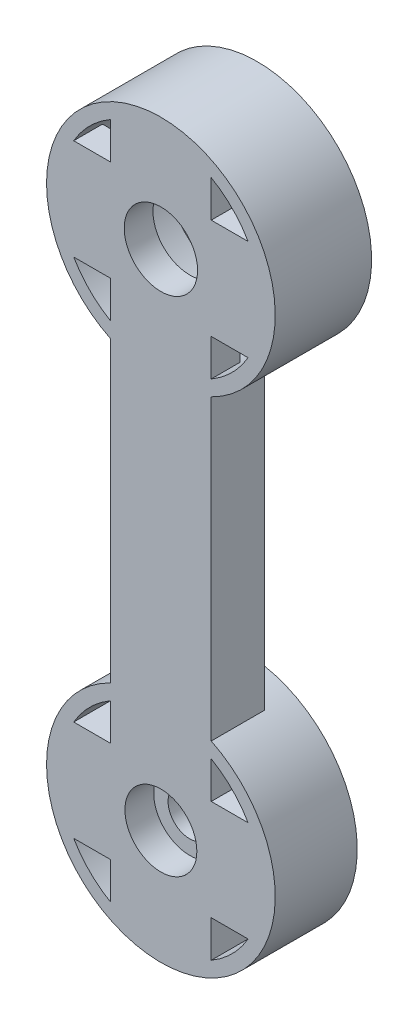
ISO-10303-21;
HEADER;
FILE_DESCRIPTION(('STEP AP214'),'2;1');
FILE_NAME('part.step','',(''),(''),'','','');
FILE_SCHEMA(('AUTOMOTIVE_DESIGN { 1 0 10303 214 1 1 1 1 }'));
ENDSEC;
DATA;
#1=APPLICATION_CONTEXT('core data for automotive mechanical design processes');
#2=APPLICATION_PROTOCOL_DEFINITION('international standard','automotive_design',2000,#1);
#3=PRODUCT_CONTEXT('',#1,'mechanical');
#4=PRODUCT('Part','Part','',(#3));
#5=PRODUCT_RELATED_PRODUCT_CATEGORY('part','',(#4));
#6=PRODUCT_DEFINITION_FORMATION('','',#4);
#7=PRODUCT_DEFINITION_CONTEXT('part definition',#1,'design');
#8=PRODUCT_DEFINITION('design','',#6,#7);
#9=PRODUCT_DEFINITION_SHAPE('','',#8);
#10=(LENGTH_UNIT() NAMED_UNIT(*) SI_UNIT(.MILLI.,.METRE.));
#11=(NAMED_UNIT(*) PLANE_ANGLE_UNIT() SI_UNIT($,.RADIAN.));
#12=(NAMED_UNIT(*) SI_UNIT($,.STERADIAN.) SOLID_ANGLE_UNIT());
#13=UNCERTAINTY_MEASURE_WITH_UNIT(LENGTH_MEASURE(1.E-05),#10,'distance_accuracy_value','');
#14=(GEOMETRIC_REPRESENTATION_CONTEXT(3) GLOBAL_UNCERTAINTY_ASSIGNED_CONTEXT((#13)) GLOBAL_UNIT_ASSIGNED_CONTEXT((#10,
#11,#12)) REPRESENTATION_CONTEXT('',''));
#15=CARTESIAN_POINT('',(0.,0.,0.));
#16=DIRECTION('',(0.,0.,1.));
#17=DIRECTION('',(1.,0.,0.));
#18=AXIS2_PLACEMENT_3D('',#15,#16,#17);
#19=CARTESIAN_POINT('',(0.,-35.,3.));
#20=DIRECTION('',(0.,0.,-1.));
#21=DIRECTION('',(-1.,0.,0.));
#22=AXIS2_PLACEMENT_3D('',#19,#20,#21);
#23=CYLINDRICAL_SURFACE('',#22,7.95);
#24=CARTESIAN_POINT('',(0.,-35.,-2.7));
#25=DIRECTION('',(0.,0.,-1.));
#26=DIRECTION('',(-1.,0.,0.));
#27=AXIS2_PLACEMENT_3D('',#24,#25,#26);
#28=CIRCLE('',#27,7.95);
#29=CARTESIAN_POINT('',(-7.95,-35.,-2.7));
#30=VERTEX_POINT('',#29);
#31=EDGE_CURVE('E315',#30,#30,#28,.T.);
#32=ORIENTED_EDGE('',*,*,#31,.F.);
#33=EDGE_LOOP('',(#32));
#34=FACE_BOUND('',#33,.T.);
#35=CARTESIAN_POINT('',(0.,-35.,-0.7));
#36=DIRECTION('',(0.,0.,-1.));
#37=DIRECTION('',(-1.,0.,0.));
#38=AXIS2_PLACEMENT_3D('',#35,#36,#37);
#39=CIRCLE('',#38,7.95);
#40=CARTESIAN_POINT('',(3.50000000000001,-27.8618980113759,-0.7));
#41=VERTEX_POINT('',#40);
#42=CARTESIAN_POINT('',(-3.5,-27.8618980113759,-0.7));
#43=VERTEX_POINT('',#42);
#44=EDGE_CURVE('E257',#41,#43,#39,.F.);
#45=ORIENTED_EDGE('',*,*,#44,.F.);
#46=DIRECTION('',(0.,0.,-1.));
#47=VECTOR('',#46,1.);
#48=CARTESIAN_POINT('',(3.5,-27.8618980113759,3.));
#49=LINE('',#48,#47);
#50=CARTESIAN_POINT('',(3.5,-27.8618980113759,3.));
#51=VERTEX_POINT('',#50);
#52=EDGE_CURVE('E248',#51,#41,#49,.T.);
#53=ORIENTED_EDGE('',*,*,#52,.F.);
#54=CARTESIAN_POINT('',(0.,-35.,3.));
#55=DIRECTION('',(0.,0.,1.));
#56=DIRECTION('',(1.,0.,0.));
#57=AXIS2_PLACEMENT_3D('',#54,#55,#56);
#58=CIRCLE('',#57,7.95);
#59=CARTESIAN_POINT('',(-3.5,-27.8618980113759,3.));
#60=VERTEX_POINT('',#59);
#61=EDGE_CURVE('E388',#51,#60,#58,.F.);
#62=ORIENTED_EDGE('',*,*,#61,.T.);
#63=DIRECTION('',(0.,0.,-1.));
#64=VECTOR('',#63,1.);
#65=CARTESIAN_POINT('',(-3.5,-27.8618980113759,3.));
#66=LINE('',#65,#64);
#67=EDGE_CURVE('E519',#60,#43,#66,.T.);
#68=ORIENTED_EDGE('',*,*,#67,.T.);
#69=EDGE_LOOP('',(#45,#53,#62,#68));
#70=FACE_BOUND('',#69,.T.);
#71=ADVANCED_FACE('F47',(#34,#70),#23,.T.);
#72=CARTESIAN_POINT('',(0.,0.,3.));
#73=DIRECTION('',(0.,0.,-1.));
#74=DIRECTION('',(-1.,0.,0.));
#75=AXIS2_PLACEMENT_3D('',#72,#73,#74);
#76=CYLINDRICAL_SURFACE('',#75,7.95);
#77=CARTESIAN_POINT('',(0.,0.,-3.7));
#78=DIRECTION('',(0.,0.,-1.));
#79=DIRECTION('',(-1.,0.,0.));
#80=AXIS2_PLACEMENT_3D('',#77,#78,#79);
#81=CIRCLE('',#80,7.95);
#82=CARTESIAN_POINT('',(-7.95,0.,-3.7));
#83=VERTEX_POINT('',#82);
#84=EDGE_CURVE('E323',#83,#83,#81,.T.);
#85=ORIENTED_EDGE('',*,*,#84,.F.);
#86=EDGE_LOOP('',(#85));
#87=FACE_BOUND('',#86,.T.);
#88=DIRECTION('',(0.,0.,-1.));
#89=VECTOR('',#88,1.);
#90=CARTESIAN_POINT('',(3.5,-7.13810198862415,3.));
#91=LINE('',#90,#89);
#92=CARTESIAN_POINT('',(3.5,-7.13810198862415,3.));
#93=VERTEX_POINT('',#92);
#94=CARTESIAN_POINT('',(3.5,-7.13810198862415,-0.7));
#95=VERTEX_POINT('',#94);
#96=EDGE_CURVE('E238',#93,#95,#91,.T.);
#97=ORIENTED_EDGE('',*,*,#96,.T.);
#98=CARTESIAN_POINT('',(0.,0.,-0.7));
#99=DIRECTION('',(0.,0.,-1.));
#100=DIRECTION('',(-1.,0.,0.));
#101=AXIS2_PLACEMENT_3D('',#98,#99,#100);
#102=CIRCLE('',#101,7.95);
#103=CARTESIAN_POINT('',(-3.5,-7.13810198862415,-0.7));
#104=VERTEX_POINT('',#103);
#105=EDGE_CURVE('E242',#104,#95,#102,.F.);
#106=ORIENTED_EDGE('',*,*,#105,.F.);
#107=DIRECTION('',(0.,0.,-1.));
#108=VECTOR('',#107,1.);
#109=CARTESIAN_POINT('',(-3.5,-7.13810198862415,3.));
#110=LINE('',#109,#108);
#111=CARTESIAN_POINT('',(-3.5,-7.13810198862415,3.));
#112=VERTEX_POINT('',#111);
#113=EDGE_CURVE('E65',#112,#104,#110,.T.);
#114=ORIENTED_EDGE('',*,*,#113,.F.);
#115=CARTESIAN_POINT('',(0.,0.,3.));
#116=DIRECTION('',(0.,0.,1.));
#117=DIRECTION('',(1.,0.,0.));
#118=AXIS2_PLACEMENT_3D('',#115,#116,#117);
#119=CIRCLE('',#118,7.95);
#120=EDGE_CURVE('E243',#93,#112,#119,.T.);
#121=ORIENTED_EDGE('',*,*,#120,.F.);
#122=EDGE_LOOP('',(#97,#106,#114,#121));
#123=FACE_BOUND('',#122,.T.);
#124=ADVANCED_FACE('F240',(#87,#123),#76,.T.);
#125=CARTESIAN_POINT('',(0.,-35.,3.));
#126=DIRECTION('',(0.,0.,-1.));
#127=DIRECTION('',(-1.,0.,0.));
#128=AXIS2_PLACEMENT_3D('',#125,#126,#127);
#129=CYLINDRICAL_SURFACE('',#128,1.5);
#130=CARTESIAN_POINT('',(0.,-35.,1.));
#131=DIRECTION('',(0.,0.,1.));
#132=DIRECTION('',(1.,0.,0.));
#133=AXIS2_PLACEMENT_3D('',#130,#131,#132);
#134=CIRCLE('',#133,1.5);
#135=CARTESIAN_POINT('',(1.5,-35.,1.));
#136=VERTEX_POINT('',#135);
#137=EDGE_CURVE('E331',#136,#136,#134,.F.);
#138=ORIENTED_EDGE('',*,*,#137,.F.);
#139=EDGE_LOOP('',(#138));
#140=FACE_BOUND('',#139,.T.);
#141=CARTESIAN_POINT('',(0.,-35.,-2.7));
#142=DIRECTION('',(0.,0.,-1.));
#143=DIRECTION('',(-1.,0.,0.));
#144=AXIS2_PLACEMENT_3D('',#141,#142,#143);
#145=CIRCLE('',#144,1.5);
#146=CARTESIAN_POINT('',(-1.5,-35.,-2.7));
#147=VERTEX_POINT('',#146);
#148=EDGE_CURVE('E303',#147,#147,#145,.F.);
#149=ORIENTED_EDGE('',*,*,#148,.F.);
#150=EDGE_LOOP('',(#149));
#151=FACE_BOUND('',#150,.T.);
#152=ADVANCED_FACE('F552',(#140,#151),#129,.F.);
#153=CARTESIAN_POINT('',(0.,-31.5,3.));
#154=DIRECTION('',(0.,-1.,0.));
#155=DIRECTION('',(0.,0.,-1.));
#156=AXIS2_PLACEMENT_3D('',#153,#154,#155);
#157=PLANE('',#156);
#158=DIRECTION('',(0.,0.,-1.));
#159=VECTOR('',#158,1.);
#160=CARTESIAN_POINT('',(6.06217782649107,-31.5,3.));
#161=LINE('',#160,#159);
#162=CARTESIAN_POINT('',(6.06217782649107,-31.5,3.));
#163=VERTEX_POINT('',#162);
#164=CARTESIAN_POINT('',(6.06217782649107,-31.5,-2.7));
#165=VERTEX_POINT('',#164);
#166=EDGE_CURVE('E494',#163,#165,#161,.T.);
#167=ORIENTED_EDGE('',*,*,#166,.T.);
#168=DIRECTION('',(1.,0.,0.));
#169=VECTOR('',#168,1.);
#170=CARTESIAN_POINT('',(0.,-31.5,-2.7));
#171=LINE('',#170,#169);
#172=CARTESIAN_POINT('',(3.5,-31.5,-2.7));
#173=VERTEX_POINT('',#172);
#174=EDGE_CURVE('E282',#173,#165,#171,.T.);
#175=ORIENTED_EDGE('',*,*,#174,.F.);
#176=DIRECTION('',(0.,0.,-1.));
#177=VECTOR('',#176,1.);
#178=CARTESIAN_POINT('',(3.5,-31.5,3.));
#179=LINE('',#178,#177);
#180=CARTESIAN_POINT('',(3.5,-31.5,3.));
#181=VERTEX_POINT('',#180);
#182=EDGE_CURVE('E487',#181,#173,#179,.T.);
#183=ORIENTED_EDGE('',*,*,#182,.F.);
#184=DIRECTION('',(-1.,0.,0.));
#185=VECTOR('',#184,1.);
#186=CARTESIAN_POINT('',(0.,-31.5,3.));
#187=LINE('',#186,#185);
#188=EDGE_CURVE('E418',#163,#181,#187,.T.);
#189=ORIENTED_EDGE('',*,*,#188,.F.);
#190=EDGE_LOOP('',(#167,#175,#183,#189));
#191=FACE_BOUND('',#190,.T.);
#192=ADVANCED_FACE('F555',(#191),#157,.F.);
#193=CARTESIAN_POINT('',(3.5,0.,3.));
#194=DIRECTION('',(1.,0.,0.));
#195=DIRECTION('',(0.,1.,0.));
#196=AXIS2_PLACEMENT_3D('',#193,#194,#195);
#197=PLANE('',#196);
#198=ORIENTED_EDGE('',*,*,#182,.T.);
#199=DIRECTION('',(0.,-1.,0.));
#200=VECTOR('',#199,1.);
#201=CARTESIAN_POINT('',(3.5,0.,-2.7));
#202=LINE('',#201,#200);
#203=CARTESIAN_POINT('',(3.5,-28.9378221735089,-2.7));
#204=VERTEX_POINT('',#203);
#205=EDGE_CURVE('E276',#204,#173,#202,.T.);
#206=ORIENTED_EDGE('',*,*,#205,.F.);
#207=DIRECTION('',(0.,0.,-1.));
#208=VECTOR('',#207,1.);
#209=CARTESIAN_POINT('',(3.5,-28.9378221735089,3.));
#210=LINE('',#209,#208);
#211=CARTESIAN_POINT('',(3.5,-28.9378221735089,3.));
#212=VERTEX_POINT('',#211);
#213=EDGE_CURVE('E497',#212,#204,#210,.T.);
#214=ORIENTED_EDGE('',*,*,#213,.F.);
#215=DIRECTION('',(0.,-1.,0.));
#216=VECTOR('',#215,1.);
#217=CARTESIAN_POINT('',(3.5,0.,3.));
#218=LINE('',#217,#216);
#219=EDGE_CURVE('E421',#212,#181,#218,.T.);
#220=ORIENTED_EDGE('',*,*,#219,.T.);
#221=EDGE_LOOP('',(#198,#206,#214,#220));
#222=FACE_BOUND('',#221,.T.);
#223=ADVANCED_FACE('F676',(#222),#197,.T.);
#224=CARTESIAN_POINT('',(0.,-31.5,3.));
#225=DIRECTION('',(0.,-1.,0.));
#226=DIRECTION('',(0.,0.,-1.));
#227=AXIS2_PLACEMENT_3D('',#224,#225,#226);
#228=PLANE('',#227);
#229=DIRECTION('',(0.,0.,-1.));
#230=VECTOR('',#229,1.);
#231=CARTESIAN_POINT('',(-3.5,-31.5,3.));
#232=LINE('',#231,#230);
#233=CARTESIAN_POINT('',(-3.5,-31.5,3.));
#234=VERTEX_POINT('',#233);
#235=CARTESIAN_POINT('',(-3.5,-31.5,-2.7));
#236=VERTEX_POINT('',#235);
#237=EDGE_CURVE('E515',#234,#236,#232,.T.);
#238=ORIENTED_EDGE('',*,*,#237,.T.);
#239=DIRECTION('',(1.,0.,0.));
#240=VECTOR('',#239,1.);
#241=CARTESIAN_POINT('',(0.,-31.5,-2.7));
#242=LINE('',#241,#240);
#243=CARTESIAN_POINT('',(-6.06217782649107,-31.5,-2.7));
#244=VERTEX_POINT('',#243);
#245=EDGE_CURVE('E311',#244,#236,#242,.T.);
#246=ORIENTED_EDGE('',*,*,#245,.F.);
#247=DIRECTION('',(0.,0.,-1.));
#248=VECTOR('',#247,1.);
#249=CARTESIAN_POINT('',(-6.06217782649107,-31.5,3.));
#250=LINE('',#249,#248);
#251=CARTESIAN_POINT('',(-6.06217782649107,-31.5,3.));
#252=VERTEX_POINT('',#251);
#253=EDGE_CURVE('E508',#252,#244,#250,.T.);
#254=ORIENTED_EDGE('',*,*,#253,.F.);
#255=DIRECTION('',(-1.,0.,0.));
#256=VECTOR('',#255,1.);
#257=CARTESIAN_POINT('',(0.,-31.5,3.));
#258=LINE('',#257,#256);
#259=EDGE_CURVE('E397',#234,#252,#258,.T.);
#260=ORIENTED_EDGE('',*,*,#259,.F.);
#261=EDGE_LOOP('',(#238,#246,#254,#260));
#262=FACE_BOUND('',#261,.T.);
#263=ADVANCED_FACE('F674',(#262),#228,.F.);
#264=CARTESIAN_POINT('',(0.,-35.,3.));
#265=DIRECTION('',(0.,0.,-1.));
#266=DIRECTION('',(-1.,0.,0.));
#267=AXIS2_PLACEMENT_3D('',#264,#265,#266);
#268=CYLINDRICAL_SURFACE('',#267,7.);
#269=ORIENTED_EDGE('',*,*,#253,.T.);
#270=CARTESIAN_POINT('',(0.,-35.,-2.7));
#271=DIRECTION('',(0.,0.,-1.));
#272=DIRECTION('',(-1.,0.,0.));
#273=AXIS2_PLACEMENT_3D('',#270,#271,#272);
#274=CIRCLE('',#273,7.);
#275=CARTESIAN_POINT('',(-3.5,-28.9378221735089,-2.7));
#276=VERTEX_POINT('',#275);
#277=EDGE_CURVE('E277',#244,#276,#274,.T.);
#278=ORIENTED_EDGE('',*,*,#277,.T.);
#279=DIRECTION('',(0.,0.,-1.));
#280=VECTOR('',#279,1.);
#281=CARTESIAN_POINT('',(-3.5,-28.9378221735089,3.));
#282=LINE('',#281,#280);
#283=CARTESIAN_POINT('',(-3.5,-28.9378221735089,3.));
#284=VERTEX_POINT('',#283);
#285=EDGE_CURVE('E518',#284,#276,#282,.T.);
#286=ORIENTED_EDGE('',*,*,#285,.F.);
#287=CARTESIAN_POINT('',(0.,-35.,3.));
#288=DIRECTION('',(0.,0.,1.));
#289=DIRECTION('',(1.,0.,0.));
#290=AXIS2_PLACEMENT_3D('',#287,#288,#289);
#291=CIRCLE('',#290,7.);
#292=EDGE_CURVE('E401',#252,#284,#291,.F.);
#293=ORIENTED_EDGE('',*,*,#292,.F.);
#294=EDGE_LOOP('',(#269,#278,#286,#293));
#295=FACE_BOUND('',#294,.T.);
#296=ADVANCED_FACE('F667',(#295),#268,.F.);
#297=CARTESIAN_POINT('',(3.50000000000003,0.,3.));
#298=DIRECTION('',(1.,0.,0.));
#299=DIRECTION('',(0.,1.,0.));
#300=AXIS2_PLACEMENT_3D('',#297,#298,#299);
#301=PLANE('',#300);
#302=DIRECTION('',(0.,0.,-1.));
#303=VECTOR('',#302,1.);
#304=CARTESIAN_POINT('',(3.5,-41.0621778264911,3.));
#305=LINE('',#304,#303);
#306=CARTESIAN_POINT('',(3.5,-41.0621778264911,3.));
#307=VERTEX_POINT('',#306);
#308=CARTESIAN_POINT('',(3.5,-41.0621778264911,-2.7));
#309=VERTEX_POINT('',#308);
#310=EDGE_CURVE('E531',#307,#309,#305,.T.);
#311=ORIENTED_EDGE('',*,*,#310,.T.);
#312=DIRECTION('',(0.,-1.,0.));
#313=VECTOR('',#312,1.);
#314=CARTESIAN_POINT('',(3.50000000000003,0.,-2.7));
#315=LINE('',#314,#313);
#316=CARTESIAN_POINT('',(3.5,-38.5,-2.7));
#317=VERTEX_POINT('',#316);
#318=EDGE_CURVE('E290',#317,#309,#315,.T.);
#319=ORIENTED_EDGE('',*,*,#318,.F.);
#320=DIRECTION('',(0.,0.,-1.));
#321=VECTOR('',#320,1.);
#322=CARTESIAN_POINT('',(3.5,-38.5,3.));
#323=LINE('',#322,#321);
#324=CARTESIAN_POINT('',(3.5,-38.5,3.));
#325=VERTEX_POINT('',#324);
#326=EDGE_CURVE('E525',#325,#317,#323,.T.);
#327=ORIENTED_EDGE('',*,*,#326,.F.);
#328=DIRECTION('',(0.,-1.,0.));
#329=VECTOR('',#328,1.);
#330=CARTESIAN_POINT('',(3.50000000000003,0.,3.));
#331=LINE('',#330,#329);
#332=EDGE_CURVE('E376',#325,#307,#331,.T.);
#333=ORIENTED_EDGE('',*,*,#332,.T.);
#334=EDGE_LOOP('',(#311,#319,#327,#333));
#335=FACE_BOUND('',#334,.T.);
#336=ADVANCED_FACE('F652',(#335),#301,.T.);
#337=CARTESIAN_POINT('',(0.,-38.5,3.));
#338=DIRECTION('',(0.,-1.,0.));
#339=DIRECTION('',(0.,0.,-1.));
#340=AXIS2_PLACEMENT_3D('',#337,#338,#339);
#341=PLANE('',#340);
#342=ORIENTED_EDGE('',*,*,#326,.T.);
#343=DIRECTION('',(-1.,0.,0.));
#344=VECTOR('',#343,1.);
#345=CARTESIAN_POINT('',(0.,-38.5,-2.7));
#346=LINE('',#345,#344);
#347=CARTESIAN_POINT('',(6.06217782649107,-38.5,-2.7));
#348=VERTEX_POINT('',#347);
#349=EDGE_CURVE('E286',#348,#317,#346,.T.);
#350=ORIENTED_EDGE('',*,*,#349,.F.);
#351=DIRECTION('',(0.,0.,-1.));
#352=VECTOR('',#351,1.);
#353=CARTESIAN_POINT('',(6.06217782649107,-38.5,3.));
#354=LINE('',#353,#352);
#355=CARTESIAN_POINT('',(6.06217782649107,-38.5,3.));
#356=VERTEX_POINT('',#355);
#357=EDGE_CURVE('E534',#356,#348,#354,.T.);
#358=ORIENTED_EDGE('',*,*,#357,.F.);
#359=DIRECTION('',(-1.,0.,0.));
#360=VECTOR('',#359,1.);
#361=CARTESIAN_POINT('',(0.,-38.5,3.));
#362=LINE('',#361,#360);
#363=EDGE_CURVE('E381',#356,#325,#362,.T.);
#364=ORIENTED_EDGE('',*,*,#363,.T.);
#365=EDGE_LOOP('',(#342,#350,#358,#364));
#366=FACE_BOUND('',#365,.T.);
#367=ADVANCED_FACE('F655',(#366),#341,.T.);
#368=CARTESIAN_POINT('',(0.,-38.5,3.));
#369=DIRECTION('',(0.,-1.,0.));
#370=DIRECTION('',(0.,0.,-1.));
#371=AXIS2_PLACEMENT_3D('',#368,#369,#370);
#372=PLANE('',#371);
#373=DIRECTION('',(0.,0.,-1.));
#374=VECTOR('',#373,1.);
#375=CARTESIAN_POINT('',(-6.06217782649107,-38.5,3.));
#376=LINE('',#375,#374);
#377=CARTESIAN_POINT('',(-6.06217782649107,-38.5,3.));
#378=VERTEX_POINT('',#377);
#379=CARTESIAN_POINT('',(-6.06217782649107,-38.5,-2.7));
#380=VERTEX_POINT('',#379);
#381=EDGE_CURVE('E457',#378,#380,#376,.T.);
#382=ORIENTED_EDGE('',*,*,#381,.T.);
#383=DIRECTION('',(-1.,0.,0.));
#384=VECTOR('',#383,1.);
#385=CARTESIAN_POINT('',(0.,-38.5,-2.7));
#386=LINE('',#385,#384);
#387=CARTESIAN_POINT('',(-3.5,-38.5,-2.7));
#388=VERTEX_POINT('',#387);
#389=EDGE_CURVE('E299',#388,#380,#386,.T.);
#390=ORIENTED_EDGE('',*,*,#389,.F.);
#391=DIRECTION('',(0.,0.,-1.));
#392=VECTOR('',#391,1.);
#393=CARTESIAN_POINT('',(-3.5,-38.5,3.));
#394=LINE('',#393,#392);
#395=CARTESIAN_POINT('',(-3.5,-38.5,3.));
#396=VERTEX_POINT('',#395);
#397=EDGE_CURVE('E535',#396,#388,#394,.T.);
#398=ORIENTED_EDGE('',*,*,#397,.F.);
#399=DIRECTION('',(-1.,0.,0.));
#400=VECTOR('',#399,1.);
#401=CARTESIAN_POINT('',(0.,-38.5,3.));
#402=LINE('',#401,#400);
#403=EDGE_CURVE('E366',#396,#378,#402,.T.);
#404=ORIENTED_EDGE('',*,*,#403,.T.);
#405=EDGE_LOOP('',(#382,#390,#398,#404));
#406=FACE_BOUND('',#405,.T.);
#407=ADVANCED_FACE('F49',(#406),#372,.T.);
#408=CARTESIAN_POINT('',(-3.5,0.,3.));
#409=DIRECTION('',(1.,0.,0.));
#410=DIRECTION('',(0.,0.,-1.));
#411=AXIS2_PLACEMENT_3D('',#408,#409,#410);
#412=PLANE('',#411);
#413=ORIENTED_EDGE('',*,*,#397,.T.);
#414=DIRECTION('',(0.,1.,0.));
#415=VECTOR('',#414,1.);
#416=CARTESIAN_POINT('',(-3.5,0.,-2.7));
#417=LINE('',#416,#415);
#418=CARTESIAN_POINT('',(-3.5,-41.0621778264911,-2.7));
#419=VERTEX_POINT('',#418);
#420=EDGE_CURVE('E295',#419,#388,#417,.T.);
#421=ORIENTED_EDGE('',*,*,#420,.F.);
#422=DIRECTION('',(0.,0.,-1.));
#423=VECTOR('',#422,1.);
#424=CARTESIAN_POINT('',(-3.5,-41.0621778264911,3.));
#425=LINE('',#424,#423);
#426=CARTESIAN_POINT('',(-3.5,-41.0621778264911,3.));
#427=VERTEX_POINT('',#426);
#428=EDGE_CURVE('E542',#427,#419,#425,.T.);
#429=ORIENTED_EDGE('',*,*,#428,.F.);
#430=DIRECTION('',(0.,-1.,0.));
#431=VECTOR('',#430,1.);
#432=CARTESIAN_POINT('',(-3.5,0.,3.));
#433=LINE('',#432,#431);
#434=EDGE_CURVE('E370',#396,#427,#433,.T.);
#435=ORIENTED_EDGE('',*,*,#434,.F.);
#436=EDGE_LOOP('',(#413,#421,#429,#435));
#437=FACE_BOUND('',#436,.T.);
#438=ADVANCED_FACE('F700',(#437),#412,.F.);
#439=CARTESIAN_POINT('',(0.,-35.,3.));
#440=DIRECTION('',(0.,0.,-1.));
#441=DIRECTION('',(-1.,0.,0.));
#442=AXIS2_PLACEMENT_3D('',#439,#440,#441);
#443=CYLINDRICAL_SURFACE('',#442,7.);
#444=ORIENTED_EDGE('',*,*,#213,.T.);
#445=EDGE_CURVE('E272',#204,#165,#274,.T.);
#446=ORIENTED_EDGE('',*,*,#445,.T.);
#447=ORIENTED_EDGE('',*,*,#166,.F.);
#448=CARTESIAN_POINT('',(0.,-35.,3.));
#449=DIRECTION('',(0.,0.,1.));
#450=DIRECTION('',(1.,0.,0.));
#451=AXIS2_PLACEMENT_3D('',#448,#449,#450);
#452=CIRCLE('',#451,7.);
#453=EDGE_CURVE('E425',#212,#163,#452,.F.);
#454=ORIENTED_EDGE('',*,*,#453,.F.);
#455=EDGE_LOOP('',(#444,#446,#447,#454));
#456=FACE_BOUND('',#455,.T.);
#457=ADVANCED_FACE('F702',(#456),#443,.F.);
#458=CARTESIAN_POINT('',(-3.5,0.,3.));
#459=DIRECTION('',(1.,0.,0.));
#460=DIRECTION('',(0.,0.,-1.));
#461=AXIS2_PLACEMENT_3D('',#458,#459,#460);
#462=PLANE('',#461);
#463=ORIENTED_EDGE('',*,*,#285,.T.);
#464=DIRECTION('',(0.,1.,0.));
#465=VECTOR('',#464,1.);
#466=CARTESIAN_POINT('',(-3.5,0.,-2.7));
#467=LINE('',#466,#465);
#468=EDGE_CURVE('E307',#236,#276,#467,.T.);
#469=ORIENTED_EDGE('',*,*,#468,.F.);
#470=ORIENTED_EDGE('',*,*,#237,.F.);
#471=DIRECTION('',(0.,-1.,0.));
#472=VECTOR('',#471,1.);
#473=CARTESIAN_POINT('',(-3.5,0.,3.));
#474=LINE('',#473,#472);
#475=EDGE_CURVE('E404',#284,#234,#474,.T.);
#476=ORIENTED_EDGE('',*,*,#475,.F.);
#477=EDGE_LOOP('',(#463,#469,#470,#476));
#478=FACE_BOUND('',#477,.T.);
#479=ADVANCED_FACE('F673',(#478),#462,.F.);
#480=CARTESIAN_POINT('',(0.,-35.,3.));
#481=DIRECTION('',(0.,0.,-1.));
#482=DIRECTION('',(-1.,0.,0.));
#483=AXIS2_PLACEMENT_3D('',#480,#481,#482);
#484=CYLINDRICAL_SURFACE('',#483,7.);
#485=ORIENTED_EDGE('',*,*,#357,.T.);
#486=EDGE_CURVE('E278',#348,#309,#274,.T.);
#487=ORIENTED_EDGE('',*,*,#486,.T.);
#488=ORIENTED_EDGE('',*,*,#310,.F.);
#489=CARTESIAN_POINT('',(0.,-35.,3.));
#490=DIRECTION('',(0.,0.,1.));
#491=DIRECTION('',(1.,0.,0.));
#492=AXIS2_PLACEMENT_3D('',#489,#490,#491);
#493=CIRCLE('',#492,7.);
#494=EDGE_CURVE('E377',#356,#307,#493,.F.);
#495=ORIENTED_EDGE('',*,*,#494,.F.);
#496=EDGE_LOOP('',(#485,#487,#488,#495));
#497=FACE_BOUND('',#496,.T.);
#498=ADVANCED_FACE('F648',(#497),#484,.F.);
#499=ORIENTED_EDGE('',*,*,#428,.T.);
#500=EDGE_CURVE('E294',#419,#380,#274,.T.);
#501=ORIENTED_EDGE('',*,*,#500,.T.);
#502=ORIENTED_EDGE('',*,*,#381,.F.);
#503=EDGE_CURVE('E373',#427,#378,#493,.F.);
#504=ORIENTED_EDGE('',*,*,#503,.F.);
#505=EDGE_LOOP('',(#499,#501,#502,#504));
#506=FACE_BOUND('',#505,.T.);
#507=ADVANCED_FACE('F696',(#506),#484,.F.);
#508=CARTESIAN_POINT('',(0.,3.5,3.));
#509=DIRECTION('',(0.,1.,0.));
#510=DIRECTION('',(0.,0.,1.));
#511=AXIS2_PLACEMENT_3D('',#508,#509,#510);
#512=PLANE('',#511);
#513=DIRECTION('',(0.,0.,-1.));
#514=VECTOR('',#513,1.);
#515=CARTESIAN_POINT('',(6.06217782649107,3.5,3.));
#516=LINE('',#515,#514);
#517=CARTESIAN_POINT('',(6.06217782649107,3.5,3.));
#518=VERTEX_POINT('',#517);
#519=CARTESIAN_POINT('',(6.06217782649107,3.5,1.));
#520=VERTEX_POINT('',#519);
#521=EDGE_CURVE('E57',#518,#520,#516,.T.);
#522=ORIENTED_EDGE('',*,*,#521,.T.);
#523=DIRECTION('',(-1.,0.,0.));
#524=VECTOR('',#523,1.);
#525=CARTESIAN_POINT('',(0.,3.5,1.));
#526=LINE('',#525,#524);
#527=CARTESIAN_POINT('',(3.5,3.5,1.));
#528=VERTEX_POINT('',#527);
#529=EDGE_CURVE('E351',#520,#528,#526,.T.);
#530=ORIENTED_EDGE('',*,*,#529,.T.);
#531=DIRECTION('',(0.,0.,-1.));
#532=VECTOR('',#531,1.);
#533=CARTESIAN_POINT('',(3.5,3.5,3.));
#534=LINE('',#533,#532);
#535=CARTESIAN_POINT('',(3.5,3.5,3.));
#536=VERTEX_POINT('',#535);
#537=EDGE_CURVE('E462',#536,#528,#534,.T.);
#538=ORIENTED_EDGE('',*,*,#537,.F.);
#539=DIRECTION('',(1.,0.,0.));
#540=VECTOR('',#539,1.);
#541=CARTESIAN_POINT('',(0.,3.5,3.));
#542=LINE('',#541,#540);
#543=EDGE_CURVE('E451',#536,#518,#542,.T.);
#544=ORIENTED_EDGE('',*,*,#543,.T.);
#545=EDGE_LOOP('',(#522,#530,#538,#544));
#546=FACE_BOUND('',#545,.T.);
#547=ADVANCED_FACE('F605',(#546),#512,.T.);
#548=CARTESIAN_POINT('',(0.,3.5,3.));
#549=DIRECTION('',(0.,-1.,0.));
#550=DIRECTION('',(0.,0.,-1.));
#551=AXIS2_PLACEMENT_3D('',#548,#549,#550);
#552=PLANE('',#551);
#553=DIRECTION('',(1.,0.,0.));
#554=VECTOR('',#553,1.);
#555=CARTESIAN_POINT('',(0.,3.5,1.));
#556=LINE('',#555,#554);
#557=CARTESIAN_POINT('',(-6.06217782649107,3.5,1.));
#558=VERTEX_POINT('',#557);
#559=CARTESIAN_POINT('',(-3.5,3.5,1.));
#560=VERTEX_POINT('',#559);
#561=EDGE_CURVE('E345',#558,#560,#556,.T.);
#562=ORIENTED_EDGE('',*,*,#561,.F.);
#563=DIRECTION('',(0.,0.,-1.));
#564=VECTOR('',#563,1.);
#565=CARTESIAN_POINT('',(-6.06217782649107,3.5,3.));
#566=LINE('',#565,#564);
#567=CARTESIAN_POINT('',(-6.06217782649107,3.5,3.));
#568=VERTEX_POINT('',#567);
#569=EDGE_CURVE('E463',#568,#558,#566,.T.);
#570=ORIENTED_EDGE('',*,*,#569,.F.);
#571=DIRECTION('',(-1.,0.,0.));
#572=VECTOR('',#571,1.);
#573=CARTESIAN_POINT('',(0.,3.5,3.));
#574=LINE('',#573,#572);
#575=CARTESIAN_POINT('',(-3.5,3.5,3.));
#576=VERTEX_POINT('',#575);
#577=EDGE_CURVE('E439',#576,#568,#574,.T.);
#578=ORIENTED_EDGE('',*,*,#577,.F.);
#579=DIRECTION('',(0.,0.,-1.));
#580=VECTOR('',#579,1.);
#581=CARTESIAN_POINT('',(-3.5,3.5,3.));
#582=LINE('',#581,#580);
#583=EDGE_CURVE('E470',#576,#560,#582,.T.);
#584=ORIENTED_EDGE('',*,*,#583,.T.);
#585=EDGE_LOOP('',(#562,#570,#578,#584));
#586=FACE_BOUND('',#585,.T.);
#587=ADVANCED_FACE('F621',(#586),#552,.F.);
#588=CARTESIAN_POINT('',(0.,-3.5,3.));
#589=DIRECTION('',(0.,-1.,0.));
#590=DIRECTION('',(0.,0.,-1.));
#591=AXIS2_PLACEMENT_3D('',#588,#589,#590);
#592=PLANE('',#591);
#593=DIRECTION('',(0.,0.,-1.));
#594=VECTOR('',#593,1.);
#595=CARTESIAN_POINT('',(-6.06217782649107,-3.5,3.));
#596=LINE('',#595,#594);
#597=CARTESIAN_POINT('',(-6.06217782649107,-3.5,3.));
#598=VERTEX_POINT('',#597);
#599=CARTESIAN_POINT('',(-6.06217782649107,-3.5,1.));
#600=VERTEX_POINT('',#599);
#601=EDGE_CURVE('E482',#598,#600,#596,.T.);
#602=ORIENTED_EDGE('',*,*,#601,.T.);
#603=DIRECTION('',(1.,0.,0.));
#604=VECTOR('',#603,1.);
#605=CARTESIAN_POINT('',(0.,-3.5,1.));
#606=LINE('',#605,#604);
#607=CARTESIAN_POINT('',(-3.5,-3.5,1.));
#608=VERTEX_POINT('',#607);
#609=EDGE_CURVE('E358',#600,#608,#606,.T.);
#610=ORIENTED_EDGE('',*,*,#609,.T.);
#611=DIRECTION('',(0.,0.,-1.));
#612=VECTOR('',#611,1.);
#613=CARTESIAN_POINT('',(-3.5,-3.5,3.));
#614=LINE('',#613,#612);
#615=CARTESIAN_POINT('',(-3.5,-3.5,3.));
#616=VERTEX_POINT('',#615);
#617=EDGE_CURVE('E475',#616,#608,#614,.T.);
#618=ORIENTED_EDGE('',*,*,#617,.F.);
#619=DIRECTION('',(-1.,0.,0.));
#620=VECTOR('',#619,1.);
#621=CARTESIAN_POINT('',(0.,-3.5,3.));
#622=LINE('',#621,#620);
#623=EDGE_CURVE('E428',#616,#598,#622,.T.);
#624=ORIENTED_EDGE('',*,*,#623,.T.);
#625=EDGE_LOOP('',(#602,#610,#618,#624));
#626=FACE_BOUND('',#625,.T.);
#627=ADVANCED_FACE('F625',(#626),#592,.T.);
#628=CARTESIAN_POINT('',(-3.5,0.,3.));
#629=DIRECTION('',(1.,0.,0.));
#630=DIRECTION('',(0.,0.,-1.));
#631=AXIS2_PLACEMENT_3D('',#628,#629,#630);
#632=PLANE('',#631);
#633=DIRECTION('',(0.,1.,0.));
#634=VECTOR('',#633,1.);
#635=CARTESIAN_POINT('',(-3.5,0.,1.));
#636=LINE('',#635,#634);
#637=CARTESIAN_POINT('',(-3.5,-6.06217782649107,1.));
#638=VERTEX_POINT('',#637);
#639=EDGE_CURVE('E355',#638,#608,#636,.T.);
#640=ORIENTED_EDGE('',*,*,#639,.F.);
#641=DIRECTION('',(0.,0.,-1.));
#642=VECTOR('',#641,1.);
#643=CARTESIAN_POINT('',(-3.5,-6.06217782649107,3.));
#644=LINE('',#643,#642);
#645=CARTESIAN_POINT('',(-3.5,-6.06217782649107,3.));
#646=VERTEX_POINT('',#645);
#647=EDGE_CURVE('E486',#646,#638,#644,.T.);
#648=ORIENTED_EDGE('',*,*,#647,.F.);
#649=DIRECTION('',(0.,-1.,0.));
#650=VECTOR('',#649,1.);
#651=CARTESIAN_POINT('',(-3.5,0.,3.));
#652=LINE('',#651,#650);
#653=EDGE_CURVE('E432',#616,#646,#652,.T.);
#654=ORIENTED_EDGE('',*,*,#653,.F.);
#655=ORIENTED_EDGE('',*,*,#617,.T.);
#656=EDGE_LOOP('',(#640,#648,#654,#655));
#657=FACE_BOUND('',#656,.T.);
#658=ADVANCED_FACE('F628',(#657),#632,.F.);
#659=CARTESIAN_POINT('',(3.5,0.,3.));
#660=DIRECTION('',(1.,0.,0.));
#661=DIRECTION('',(0.,1.,0.));
#662=AXIS2_PLACEMENT_3D('',#659,#660,#661);
#663=PLANE('',#662);
#664=DIRECTION('',(0.,0.,-1.));
#665=VECTOR('',#664,1.);
#666=CARTESIAN_POINT('',(3.5,-6.06217782649107,3.));
#667=LINE('',#666,#665);
#668=CARTESIAN_POINT('',(3.5,-6.06217782649107,3.));
#669=VERTEX_POINT('',#668);
#670=CARTESIAN_POINT('',(3.5,-6.06217782649107,1.));
#671=VERTEX_POINT('',#670);
#672=EDGE_CURVE('E498',#669,#671,#667,.T.);
#673=ORIENTED_EDGE('',*,*,#672,.T.);
#674=DIRECTION('',(0.,1.,0.));
#675=VECTOR('',#674,1.);
#676=CARTESIAN_POINT('',(3.5,0.,1.));
#677=LINE('',#676,#675);
#678=CARTESIAN_POINT('',(3.5,-3.5,1.));
#679=VERTEX_POINT('',#678);
#680=EDGE_CURVE('E337',#671,#679,#677,.T.);
#681=ORIENTED_EDGE('',*,*,#680,.T.);
#682=DIRECTION('',(0.,0.,-1.));
#683=VECTOR('',#682,1.);
#684=CARTESIAN_POINT('',(3.5,-3.5,3.));
#685=LINE('',#684,#683);
#686=CARTESIAN_POINT('',(3.5,-3.5,3.));
#687=VERTEX_POINT('',#686);
#688=EDGE_CURVE('E507',#687,#679,#685,.T.);
#689=ORIENTED_EDGE('',*,*,#688,.F.);
#690=DIRECTION('',(0.,-1.,0.));
#691=VECTOR('',#690,1.);
#692=CARTESIAN_POINT('',(3.5,0.,3.));
#693=LINE('',#692,#691);
#694=EDGE_CURVE('E411',#687,#669,#693,.T.);
#695=ORIENTED_EDGE('',*,*,#694,.T.);
#696=EDGE_LOOP('',(#673,#681,#689,#695));
#697=FACE_BOUND('',#696,.T.);
#698=ADVANCED_FACE('F633',(#697),#663,.T.);
#699=CARTESIAN_POINT('',(3.5,0.,3.));
#700=DIRECTION('',(-1.,0.,0.));
#701=DIRECTION('',(0.,0.,1.));
#702=AXIS2_PLACEMENT_3D('',#699,#700,#701);
#703=PLANE('',#702);
#704=DIRECTION('',(0.,-1.,0.));
#705=VECTOR('',#704,1.);
#706=CARTESIAN_POINT('',(3.5,0.,1.));
#707=LINE('',#706,#705);
#708=CARTESIAN_POINT('',(3.5,6.06217782649107,1.));
#709=VERTEX_POINT('',#708);
#710=EDGE_CURVE('E348',#709,#528,#707,.T.);
#711=ORIENTED_EDGE('',*,*,#710,.F.);
#712=DIRECTION('',(0.,0.,-1.));
#713=VECTOR('',#712,1.);
#714=CARTESIAN_POINT('',(3.5,6.06217782649107,3.));
#715=LINE('',#714,#713);
#716=CARTESIAN_POINT('',(3.5,6.06217782649107,3.));
#717=VERTEX_POINT('',#716);
#718=EDGE_CURVE('E458',#717,#709,#715,.T.);
#719=ORIENTED_EDGE('',*,*,#718,.F.);
#720=DIRECTION('',(0.,1.,0.));
#721=VECTOR('',#720,1.);
#722=CARTESIAN_POINT('',(3.5,0.,3.));
#723=LINE('',#722,#721);
#724=EDGE_CURVE('E73',#536,#717,#723,.T.);
#725=ORIENTED_EDGE('',*,*,#724,.F.);
#726=ORIENTED_EDGE('',*,*,#537,.T.);
#727=EDGE_LOOP('',(#711,#719,#725,#726));
#728=FACE_BOUND('',#727,.T.);
#729=ADVANCED_FACE('F608',(#728),#703,.F.);
#730=CARTESIAN_POINT('',(-3.5,0.,3.));
#731=DIRECTION('',(-1.,0.,0.));
#732=DIRECTION('',(0.,0.,1.));
#733=AXIS2_PLACEMENT_3D('',#730,#731,#732);
#734=PLANE('',#733);
#735=DIRECTION('',(0.,0.,-1.));
#736=VECTOR('',#735,1.);
#737=CARTESIAN_POINT('',(-3.5,6.06217782649107,3.));
#738=LINE('',#737,#736);
#739=CARTESIAN_POINT('',(-3.5,6.06217782649107,3.));
#740=VERTEX_POINT('',#739);
#741=CARTESIAN_POINT('',(-3.5,6.06217782649107,1.));
#742=VERTEX_POINT('',#741);
#743=EDGE_CURVE('E474',#740,#742,#738,.T.);
#744=ORIENTED_EDGE('',*,*,#743,.T.);
#745=DIRECTION('',(0.,-1.,0.));
#746=VECTOR('',#745,1.);
#747=CARTESIAN_POINT('',(-3.5,0.,1.));
#748=LINE('',#747,#746);
#749=EDGE_CURVE('E341',#742,#560,#748,.T.);
#750=ORIENTED_EDGE('',*,*,#749,.T.);
#751=ORIENTED_EDGE('',*,*,#583,.F.);
#752=DIRECTION('',(0.,1.,0.));
#753=VECTOR('',#752,1.);
#754=CARTESIAN_POINT('',(-3.5,0.,3.));
#755=LINE('',#754,#753);
#756=EDGE_CURVE('E446',#576,#740,#755,.T.);
#757=ORIENTED_EDGE('',*,*,#756,.T.);
#758=EDGE_LOOP('',(#744,#750,#751,#757));
#759=FACE_BOUND('',#758,.T.);
#760=ADVANCED_FACE('F617',(#759),#734,.T.);
#761=CARTESIAN_POINT('',(0.,-3.5,3.));
#762=DIRECTION('',(0.,1.,0.));
#763=DIRECTION('',(0.,0.,1.));
#764=AXIS2_PLACEMENT_3D('',#761,#762,#763);
#765=PLANE('',#764);
#766=DIRECTION('',(-1.,0.,0.));
#767=VECTOR('',#766,1.);
#768=CARTESIAN_POINT('',(0.,-3.5,1.));
#769=LINE('',#768,#767);
#770=CARTESIAN_POINT('',(6.06217782649107,-3.5,1.));
#771=VERTEX_POINT('',#770);
#772=EDGE_CURVE('E11',#771,#679,#769,.T.);
#773=ORIENTED_EDGE('',*,*,#772,.F.);
#774=DIRECTION('',(0.,0.,-1.));
#775=VECTOR('',#774,1.);
#776=CARTESIAN_POINT('',(6.06217782649107,-3.5,3.));
#777=LINE('',#776,#775);
#778=CARTESIAN_POINT('',(6.06217782649107,-3.5,3.));
#779=VERTEX_POINT('',#778);
#780=EDGE_CURVE('E503',#779,#771,#777,.T.);
#781=ORIENTED_EDGE('',*,*,#780,.F.);
#782=DIRECTION('',(1.,0.,0.));
#783=VECTOR('',#782,1.);
#784=CARTESIAN_POINT('',(0.,-3.5,3.));
#785=LINE('',#784,#783);
#786=EDGE_CURVE('E415',#687,#779,#785,.T.);
#787=ORIENTED_EDGE('',*,*,#786,.F.);
#788=ORIENTED_EDGE('',*,*,#688,.T.);
#789=EDGE_LOOP('',(#773,#781,#787,#788));
#790=FACE_BOUND('',#789,.T.);
#791=ADVANCED_FACE('F638',(#790),#765,.F.);
#792=CARTESIAN_POINT('',(0.,0.,3.));
#793=DIRECTION('',(0.,0.,-1.));
#794=DIRECTION('',(-1.,0.,0.));
#795=AXIS2_PLACEMENT_3D('',#792,#793,#794);
#796=CYLINDRICAL_SURFACE('',#795,7.);
#797=CARTESIAN_POINT('',(0.,0.,1.));
#798=DIRECTION('',(0.,0.,-1.));
#799=DIRECTION('',(-1.,0.,0.));
#800=AXIS2_PLACEMENT_3D('',#797,#798,#799);
#801=CIRCLE('',#800,7.);
#802=EDGE_CURVE('E615',#520,#771,#801,.T.);
#803=ORIENTED_EDGE('',*,*,#802,.F.);
#804=ORIENTED_EDGE('',*,*,#521,.F.);
#805=CARTESIAN_POINT('',(0.,0.,3.));
#806=DIRECTION('',(0.,0.,1.));
#807=DIRECTION('',(1.,0.,0.));
#808=AXIS2_PLACEMENT_3D('',#805,#806,#807);
#809=CIRCLE('',#808,7.);
#810=EDGE_CURVE('E447',#518,#717,#809,.T.);
#811=ORIENTED_EDGE('',*,*,#810,.T.);
#812=ORIENTED_EDGE('',*,*,#718,.T.);
#813=EDGE_CURVE('E336',#742,#709,#801,.T.);
#814=ORIENTED_EDGE('',*,*,#813,.F.);
#815=ORIENTED_EDGE('',*,*,#743,.F.);
#816=EDGE_CURVE('E442',#740,#568,#809,.T.);
#817=ORIENTED_EDGE('',*,*,#816,.T.);
#818=ORIENTED_EDGE('',*,*,#569,.T.);
#819=EDGE_CURVE('E332',#600,#558,#801,.T.);
#820=ORIENTED_EDGE('',*,*,#819,.F.);
#821=ORIENTED_EDGE('',*,*,#601,.F.);
#822=CARTESIAN_POINT('',(0.,0.,3.));
#823=DIRECTION('',(0.,0.,1.));
#824=DIRECTION('',(1.,0.,0.));
#825=AXIS2_PLACEMENT_3D('',#822,#823,#824);
#826=CIRCLE('',#825,7.);
#827=EDGE_CURVE('E435',#598,#646,#826,.T.);
#828=ORIENTED_EDGE('',*,*,#827,.T.);
#829=ORIENTED_EDGE('',*,*,#647,.T.);
#830=EDGE_CURVE('E335',#671,#638,#801,.T.);
#831=ORIENTED_EDGE('',*,*,#830,.F.);
#832=ORIENTED_EDGE('',*,*,#672,.F.);
#833=CARTESIAN_POINT('',(0.,0.,3.));
#834=DIRECTION('',(0.,0.,1.));
#835=DIRECTION('',(1.,0.,0.));
#836=AXIS2_PLACEMENT_3D('',#833,#834,#835);
#837=CIRCLE('',#836,7.);
#838=EDGE_CURVE('E407',#669,#779,#837,.T.);
#839=ORIENTED_EDGE('',*,*,#838,.T.);
#840=ORIENTED_EDGE('',*,*,#780,.T.);
#841=EDGE_LOOP('',(#803,#804,#811,#812,#814,#815,#817,#818,#820,#821,#828,#829,#831,#832,#839,#840));
#842=FACE_BOUND('',#841,.T.);
#843=CARTESIAN_POINT('',(0.,0.,-3.7));
#844=DIRECTION('',(0.,0.,-1.));
#845=DIRECTION('',(-1.,0.,0.));
#846=AXIS2_PLACEMENT_3D('',#843,#844,#845);
#847=CIRCLE('',#846,7.);
#848=CARTESIAN_POINT('',(-7.,0.,-3.7));
#849=VERTEX_POINT('',#848);
#850=EDGE_CURVE('E319',#849,#849,#847,.T.);
#851=ORIENTED_EDGE('',*,*,#850,.T.);
#852=EDGE_LOOP('',(#851));
#853=FACE_BOUND('',#852,.T.);
#854=ADVANCED_FACE('F611',(#842,#853),#796,.F.);
#855=CARTESIAN_POINT('',(-3.5,0.,3.));
#856=DIRECTION('',(1.,0.,0.));
#857=DIRECTION('',(0.,0.,-1.));
#858=AXIS2_PLACEMENT_3D('',#855,#856,#857);
#859=PLANE('',#858);
#860=ORIENTED_EDGE('',*,*,#113,.T.);
#861=DIRECTION('',(0.,1.,0.));
#862=VECTOR('',#861,1.);
#863=CARTESIAN_POINT('',(-3.5,0.,-0.7));
#864=LINE('',#863,#862);
#865=EDGE_CURVE('E260',#43,#104,#864,.T.);
#866=ORIENTED_EDGE('',*,*,#865,.F.);
#867=ORIENTED_EDGE('',*,*,#67,.F.);
#868=DIRECTION('',(0.,-1.,0.));
#869=VECTOR('',#868,1.);
#870=CARTESIAN_POINT('',(-3.5,0.,3.));
#871=LINE('',#870,#869);
#872=EDGE_CURVE('E385',#112,#60,#871,.T.);
#873=ORIENTED_EDGE('',*,*,#872,.F.);
#874=EDGE_LOOP('',(#860,#866,#867,#873));
#875=FACE_BOUND('',#874,.T.);
#876=ADVANCED_FACE('F576',(#875),#859,.F.);
#877=CARTESIAN_POINT('',(3.5,0.,3.));
#878=DIRECTION('',(1.,0.,0.));
#879=DIRECTION('',(0.,1.,0.));
#880=AXIS2_PLACEMENT_3D('',#877,#878,#879);
#881=PLANE('',#880);
#882=ORIENTED_EDGE('',*,*,#52,.T.);
#883=DIRECTION('',(0.,-1.,0.));
#884=VECTOR('',#883,1.);
#885=CARTESIAN_POINT('',(3.5,0.,-0.7));
#886=LINE('',#885,#884);
#887=EDGE_CURVE('E251',#95,#41,#886,.T.);
#888=ORIENTED_EDGE('',*,*,#887,.F.);
#889=ORIENTED_EDGE('',*,*,#96,.F.);
#890=DIRECTION('',(0.,-1.,0.));
#891=VECTOR('',#890,1.);
#892=CARTESIAN_POINT('',(3.5,0.,3.));
#893=LINE('',#892,#891);
#894=EDGE_CURVE('E392',#93,#51,#893,.T.);
#895=ORIENTED_EDGE('',*,*,#894,.T.);
#896=EDGE_LOOP('',(#882,#888,#889,#895));
#897=FACE_BOUND('',#896,.T.);
#898=ADVANCED_FACE('F252',(#897),#881,.T.);
#899=CARTESIAN_POINT('',(0.,0.,3.));
#900=DIRECTION('',(0.,0.,1.));
#901=DIRECTION('',(1.,0.,0.));
#902=AXIS2_PLACEMENT_3D('',#899,#900,#901);
#903=PLANE('',#902);
#904=CARTESIAN_POINT('',(0.,0.,3.));
#905=DIRECTION('',(0.,0.,1.));
#906=DIRECTION('',(1.,0.,0.));
#907=AXIS2_PLACEMENT_3D('',#904,#905,#906);
#908=CIRCLE('',#907,2.55);
#909=CARTESIAN_POINT('',(2.55,0.,3.));
#910=VERTEX_POINT('',#909);
#911=EDGE_CURVE('E265',#910,#910,#908,.T.);
#912=ORIENTED_EDGE('',*,*,#911,.F.);
#913=EDGE_LOOP('',(#912));
#914=FACE_BOUND('',#913,.T.);
#915=CARTESIAN_POINT('',(0.,-35.,3.));
#916=DIRECTION('',(0.,0.,1.));
#917=DIRECTION('',(1.,0.,0.));
#918=AXIS2_PLACEMENT_3D('',#915,#916,#917);
#919=CIRCLE('',#918,2.5);
#920=CARTESIAN_POINT('',(2.5,-35.,3.));
#921=VERTEX_POINT('',#920);
#922=EDGE_CURVE('E362',#921,#921,#919,.T.);
#923=ORIENTED_EDGE('',*,*,#922,.F.);
#924=EDGE_LOOP('',(#923));
#925=FACE_BOUND('',#924,.T.);
#926=ORIENTED_EDGE('',*,*,#403,.F.);
#927=ORIENTED_EDGE('',*,*,#434,.T.);
#928=ORIENTED_EDGE('',*,*,#503,.T.);
#929=EDGE_LOOP('',(#926,#927,#928));
#930=FACE_BOUND('',#929,.T.);
#931=ORIENTED_EDGE('',*,*,#332,.F.);
#932=ORIENTED_EDGE('',*,*,#363,.F.);
#933=ORIENTED_EDGE('',*,*,#494,.T.);
#934=EDGE_LOOP('',(#931,#932,#933));
#935=FACE_BOUND('',#934,.T.);
#936=ORIENTED_EDGE('',*,*,#872,.T.);
#937=ORIENTED_EDGE('',*,*,#61,.F.);
#938=ORIENTED_EDGE('',*,*,#894,.F.);
#939=ORIENTED_EDGE('',*,*,#120,.T.);
#940=EDGE_LOOP('',(#936,#937,#938,#939));
#941=FACE_BOUND('',#940,.T.);
#942=ORIENTED_EDGE('',*,*,#259,.T.);
#943=ORIENTED_EDGE('',*,*,#292,.T.);
#944=ORIENTED_EDGE('',*,*,#475,.T.);
#945=EDGE_LOOP('',(#942,#943,#944));
#946=FACE_BOUND('',#945,.T.);
#947=ORIENTED_EDGE('',*,*,#838,.F.);
#948=ORIENTED_EDGE('',*,*,#694,.F.);
#949=ORIENTED_EDGE('',*,*,#786,.T.);
#950=EDGE_LOOP('',(#947,#948,#949));
#951=FACE_BOUND('',#950,.T.);
#952=ORIENTED_EDGE('',*,*,#188,.T.);
#953=ORIENTED_EDGE('',*,*,#219,.F.);
#954=ORIENTED_EDGE('',*,*,#453,.T.);
#955=EDGE_LOOP('',(#952,#953,#954));
#956=FACE_BOUND('',#955,.T.);
#957=ORIENTED_EDGE('',*,*,#623,.F.);
#958=ORIENTED_EDGE('',*,*,#653,.T.);
#959=ORIENTED_EDGE('',*,*,#827,.F.);
#960=EDGE_LOOP('',(#957,#958,#959));
#961=FACE_BOUND('',#960,.T.);
#962=ORIENTED_EDGE('',*,*,#577,.T.);
#963=ORIENTED_EDGE('',*,*,#816,.F.);
#964=ORIENTED_EDGE('',*,*,#756,.F.);
#965=EDGE_LOOP('',(#962,#963,#964));
#966=FACE_BOUND('',#965,.T.);
#967=ORIENTED_EDGE('',*,*,#810,.F.);
#968=ORIENTED_EDGE('',*,*,#543,.F.);
#969=ORIENTED_EDGE('',*,*,#724,.T.);
#970=EDGE_LOOP('',(#967,#968,#969));
#971=FACE_BOUND('',#970,.T.);
#972=ADVANCED_FACE('F578',(#914,#925,#930,#935,#941,#946,#951,#956,#961,#966,#971),#903,.T.);
#973=CARTESIAN_POINT('',(0.,-35.,1.5));
#974=DIRECTION('',(0.,0.,1.));
#975=DIRECTION('',(1.,0.,0.));
#976=AXIS2_PLACEMENT_3D('',#973,#974,#975);
#977=CYLINDRICAL_SURFACE('',#976,2.5);
#978=ORIENTED_EDGE('',*,*,#922,.T.);
#979=EDGE_LOOP('',(#978));
#980=FACE_BOUND('',#979,.T.);
#981=CARTESIAN_POINT('',(0.,-35.,1.));
#982=DIRECTION('',(0.,0.,1.));
#983=DIRECTION('',(1.,0.,0.));
#984=AXIS2_PLACEMENT_3D('',#981,#982,#983);
#985=CIRCLE('',#984,2.5);
#986=CARTESIAN_POINT('',(2.5,-35.,1.));
#987=VERTEX_POINT('',#986);
#988=EDGE_CURVE('E327',#987,#987,#985,.T.);
#989=ORIENTED_EDGE('',*,*,#988,.F.);
#990=EDGE_LOOP('',(#989));
#991=FACE_BOUND('',#990,.T.);
#992=ADVANCED_FACE('F581',(#980,#991),#977,.F.);
#993=CARTESIAN_POINT('',(0.,0.,1.));
#994=DIRECTION('',(0.,0.,-1.));
#995=DIRECTION('',(-1.,0.,0.));
#996=AXIS2_PLACEMENT_3D('',#993,#994,#995);
#997=PLANE('',#996);
#998=CARTESIAN_POINT('',(0.,0.,1.));
#999=DIRECTION('',(0.,0.,-1.));
#1000=DIRECTION('',(-1.,0.,0.));
#1001=AXIS2_PLACEMENT_3D('',#998,#999,#1000);
#1002=CIRCLE('',#1001,2.55);
#1003=CARTESIAN_POINT('',(-2.55,0.,1.));
#1004=VERTEX_POINT('',#1003);
#1005=EDGE_CURVE('E51',#1004,#1004,#1002,.T.);
#1006=ORIENTED_EDGE('',*,*,#1005,.F.);
#1007=EDGE_LOOP('',(#1006));
#1008=FACE_BOUND('',#1007,.T.);
#1009=ORIENTED_EDGE('',*,*,#819,.T.);
#1010=ORIENTED_EDGE('',*,*,#561,.T.);
#1011=ORIENTED_EDGE('',*,*,#749,.F.);
#1012=ORIENTED_EDGE('',*,*,#813,.T.);
#1013=ORIENTED_EDGE('',*,*,#710,.T.);
#1014=ORIENTED_EDGE('',*,*,#529,.F.);
#1015=ORIENTED_EDGE('',*,*,#802,.T.);
#1016=ORIENTED_EDGE('',*,*,#772,.T.);
#1017=ORIENTED_EDGE('',*,*,#680,.F.);
#1018=ORIENTED_EDGE('',*,*,#830,.T.);
#1019=ORIENTED_EDGE('',*,*,#639,.T.);
#1020=ORIENTED_EDGE('',*,*,#609,.F.);
#1021=EDGE_LOOP('',(#1009,#1010,#1011,#1012,#1013,#1014,#1015,#1016,#1017,#1018,#1019,#1020));
#1022=FACE_BOUND('',#1021,.T.);
#1023=ADVANCED_FACE('F622',(#1008,#1022),#997,.T.);
#1024=CARTESIAN_POINT('',(0.,-35.,1.));
#1025=DIRECTION('',(0.,0.,1.));
#1026=DIRECTION('',(1.,0.,0.));
#1027=AXIS2_PLACEMENT_3D('',#1024,#1025,#1026);
#1028=PLANE('',#1027);
#1029=ORIENTED_EDGE('',*,*,#988,.T.);
#1030=EDGE_LOOP('',(#1029));
#1031=FACE_BOUND('',#1030,.T.);
#1032=ORIENTED_EDGE('',*,*,#137,.T.);
#1033=EDGE_LOOP('',(#1032));
#1034=FACE_BOUND('',#1033,.T.);
#1035=ADVANCED_FACE('F550',(#1031,#1034),#1028,.T.);
#1036=CARTESIAN_POINT('',(0.,0.,-3.7));
#1037=DIRECTION('',(0.,0.,-1.));
#1038=DIRECTION('',(-1.,0.,0.));
#1039=AXIS2_PLACEMENT_3D('',#1036,#1037,#1038);
#1040=PLANE('',#1039);
#1041=ORIENTED_EDGE('',*,*,#84,.T.);
#1042=EDGE_LOOP('',(#1041));
#1043=FACE_BOUND('',#1042,.T.);
#1044=ORIENTED_EDGE('',*,*,#850,.F.);
#1045=EDGE_LOOP('',(#1044));
#1046=FACE_BOUND('',#1045,.T.);
#1047=ADVANCED_FACE('F562',(#1043,#1046),#1040,.T.);
#1048=CARTESIAN_POINT('',(0.,0.,-2.7));
#1049=DIRECTION('',(0.,0.,-1.));
#1050=DIRECTION('',(-1.,0.,0.));
#1051=AXIS2_PLACEMENT_3D('',#1048,#1049,#1050);
#1052=PLANE('',#1051);
#1053=ORIENTED_EDGE('',*,*,#445,.F.);
#1054=ORIENTED_EDGE('',*,*,#205,.T.);
#1055=ORIENTED_EDGE('',*,*,#174,.T.);
#1056=EDGE_LOOP('',(#1053,#1054,#1055));
#1057=FACE_BOUND('',#1056,.T.);
#1058=ORIENTED_EDGE('',*,*,#486,.F.);
#1059=ORIENTED_EDGE('',*,*,#349,.T.);
#1060=ORIENTED_EDGE('',*,*,#318,.T.);
#1061=EDGE_LOOP('',(#1058,#1059,#1060));
#1062=FACE_BOUND('',#1061,.T.);
#1063=ORIENTED_EDGE('',*,*,#500,.F.);
#1064=ORIENTED_EDGE('',*,*,#420,.T.);
#1065=ORIENTED_EDGE('',*,*,#389,.T.);
#1066=EDGE_LOOP('',(#1063,#1064,#1065));
#1067=FACE_BOUND('',#1066,.T.);
#1068=ORIENTED_EDGE('',*,*,#148,.T.);
#1069=EDGE_LOOP('',(#1068));
#1070=FACE_BOUND('',#1069,.T.);
#1071=ORIENTED_EDGE('',*,*,#468,.T.);
#1072=ORIENTED_EDGE('',*,*,#277,.F.);
#1073=ORIENTED_EDGE('',*,*,#245,.T.);
#1074=EDGE_LOOP('',(#1071,#1072,#1073));
#1075=FACE_BOUND('',#1074,.T.);
#1076=ORIENTED_EDGE('',*,*,#31,.T.);
#1077=EDGE_LOOP('',(#1076));
#1078=FACE_BOUND('',#1077,.T.);
#1079=ADVANCED_FACE('F559',(#1057,#1062,#1067,#1070,#1075,#1078),#1052,.T.);
#1080=CARTESIAN_POINT('',(0.,0.,-0.7));
#1081=DIRECTION('',(0.,0.,-1.));
#1082=DIRECTION('',(-1.,0.,0.));
#1083=AXIS2_PLACEMENT_3D('',#1080,#1081,#1082);
#1084=PLANE('',#1083);
#1085=ORIENTED_EDGE('',*,*,#105,.T.);
#1086=ORIENTED_EDGE('',*,*,#887,.T.);
#1087=ORIENTED_EDGE('',*,*,#44,.T.);
#1088=ORIENTED_EDGE('',*,*,#865,.T.);
#1089=EDGE_LOOP('',(#1085,#1086,#1087,#1088));
#1090=FACE_BOUND('',#1089,.T.);
#1091=ADVANCED_FACE('F259',(#1090),#1084,.T.);
#1092=CARTESIAN_POINT('',(0.,0.,-3.7));
#1093=DIRECTION('',(0.,0.,1.));
#1094=DIRECTION('',(1.,0.,0.));
#1095=AXIS2_PLACEMENT_3D('',#1092,#1093,#1094);
#1096=CYLINDRICAL_SURFACE('',#1095,2.55);
#1097=ORIENTED_EDGE('',*,*,#1005,.T.);
#1098=EDGE_LOOP('',(#1097));
#1099=FACE_BOUND('',#1098,.T.);
#1100=ORIENTED_EDGE('',*,*,#911,.T.);
#1101=EDGE_LOOP('',(#1100));
#1102=FACE_BOUND('',#1101,.T.);
#1103=ADVANCED_FACE('F850',(#1099,#1102),#1096,.F.);
#1104=CLOSED_SHELL('',(#71,#124,#152,#192,#223,#263,#296,#336,#367,#407,#438,#457,#479,#498,
#507,#547,#587,#627,#658,#698,#729,#760,#791,#854,#876,#898,#972,#992,#1023,#1035,#1047,#1079,
#1091,#1103));
#1105=MANIFOLD_SOLID_BREP('B2',#1104);
#1106=ADVANCED_BREP_SHAPE_REPRESENTATION('',(#18,#1105),#14);
#1107=SHAPE_DEFINITION_REPRESENTATION(#9,#1106);
ENDSEC;
END-ISO-10303-21;
